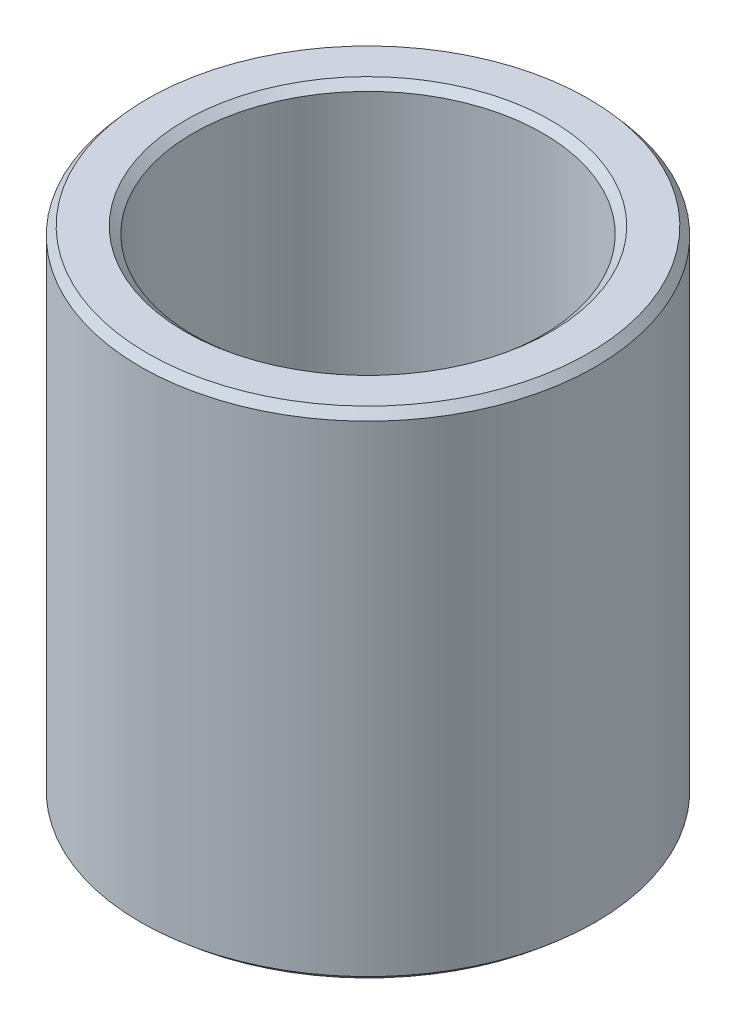
ISO-10303-21;
HEADER;
FILE_DESCRIPTION(('STEP AP214'),'2;1');
FILE_NAME('part.step','',(''),(''),'','','');
FILE_SCHEMA(('AUTOMOTIVE_DESIGN { 1 0 10303 214 1 1 1 1 }'));
ENDSEC;
DATA;
#1=APPLICATION_CONTEXT('core data for automotive mechanical design processes');
#2=APPLICATION_PROTOCOL_DEFINITION('international standard','automotive_design',2000,#1);
#3=PRODUCT_CONTEXT('',#1,'mechanical');
#4=PRODUCT('Part','Part','',(#3));
#5=PRODUCT_RELATED_PRODUCT_CATEGORY('part','',(#4));
#6=PRODUCT_DEFINITION_FORMATION('','',#4);
#7=PRODUCT_DEFINITION_CONTEXT('part definition',#1,'design');
#8=PRODUCT_DEFINITION('design','',#6,#7);
#9=PRODUCT_DEFINITION_SHAPE('','',#8);
#10=(LENGTH_UNIT() NAMED_UNIT(*) SI_UNIT(.MILLI.,.METRE.));
#11=(NAMED_UNIT(*) PLANE_ANGLE_UNIT() SI_UNIT($,.RADIAN.));
#12=(NAMED_UNIT(*) SI_UNIT($,.STERADIAN.) SOLID_ANGLE_UNIT());
#13=UNCERTAINTY_MEASURE_WITH_UNIT(LENGTH_MEASURE(1.E-05),#10,'distance_accuracy_value','');
#14=(GEOMETRIC_REPRESENTATION_CONTEXT(3) GLOBAL_UNCERTAINTY_ASSIGNED_CONTEXT((#13)) GLOBAL_UNIT_ASSIGNED_CONTEXT((#10,
#11,#12)) REPRESENTATION_CONTEXT('',''));
#15=CARTESIAN_POINT('',(0.,0.,0.));
#16=DIRECTION('',(0.,0.,1.));
#17=DIRECTION('',(1.,0.,0.));
#18=AXIS2_PLACEMENT_3D('',#15,#16,#17);
#19=CARTESIAN_POINT('',(0.,43.6122810332546,0.));
#20=DIRECTION('',(0.,-1.,0.));
#21=DIRECTION('',(0.,0.,-1.));
#22=AXIS2_PLACEMENT_3D('',#19,#20,#21);
#23=CYLINDRICAL_SURFACE('',#22,20.);
#24=CARTESIAN_POINT('',(0.,0.614561305969617,0.));
#25=DIRECTION('',(0.,1.,0.));
#26=DIRECTION('',(0.,0.,1.));
#27=AXIS2_PLACEMENT_3D('',#24,#25,#26);
#28=CIRCLE('',#27,20.);
#29=CARTESIAN_POINT('',(0.,0.614561305969617,20.));
#30=VERTEX_POINT('',#29);
#31=EDGE_CURVE('E10',#30,#30,#28,.T.);
#32=ORIENTED_EDGE('',*,*,#31,.T.);
#33=EDGE_LOOP('',(#32));
#34=FACE_BOUND('',#33,.T.);
#35=CARTESIAN_POINT('',(0.,42.8946810889523,0.));
#36=DIRECTION('',(0.,1.,0.));
#37=DIRECTION('',(0.,0.,1.));
#38=AXIS2_PLACEMENT_3D('',#35,#36,#37);
#39=CIRCLE('',#38,20.);
#40=CARTESIAN_POINT('',(0.,42.8946810889523,20.));
#41=VERTEX_POINT('',#40);
#42=EDGE_CURVE('E50',#41,#41,#39,.F.);
#43=ORIENTED_EDGE('',*,*,#42,.T.);
#44=EDGE_LOOP('',(#43));
#45=FACE_BOUND('',#44,.T.);
#46=ADVANCED_FACE('F39',(#34,#45),#23,.T.);
#47=CARTESIAN_POINT('',(0.,43.6122810332546,0.));
#48=DIRECTION('',(0.,1.,0.));
#49=DIRECTION('',(0.,0.,1.));
#50=AXIS2_PLACEMENT_3D('',#47,#48,#49);
#51=PLANE('',#50);
#52=CARTESIAN_POINT('',(0.,43.6122810332546,0.));
#53=DIRECTION('',(0.,1.,0.));
#54=DIRECTION('',(0.,0.,1.));
#55=AXIS2_PLACEMENT_3D('',#52,#53,#54);
#56=CIRCLE('',#55,16.0853511680827);
#57=CARTESIAN_POINT('',(0.,43.6122810332546,16.0853511680827));
#58=VERTEX_POINT('',#57);
#59=EDGE_CURVE('E58',#58,#58,#56,.F.);
#60=ORIENTED_EDGE('',*,*,#59,.T.);
#61=EDGE_LOOP('',(#60));
#62=FACE_BOUND('',#61,.T.);
#63=CARTESIAN_POINT('',(0.,43.6122810332546,0.));
#64=DIRECTION('',(0.,1.,0.));
#65=DIRECTION('',(0.,0.,1.));
#66=AXIS2_PLACEMENT_3D('',#63,#64,#65);
#67=CIRCLE('',#66,19.3854386940304);
#68=CARTESIAN_POINT('',(0.,43.6122810332546,19.3854386940304));
#69=VERTEX_POINT('',#68);
#70=EDGE_CURVE('E61',#69,#69,#67,.T.);
#71=ORIENTED_EDGE('',*,*,#70,.T.);
#72=EDGE_LOOP('',(#71));
#73=FACE_BOUND('',#72,.T.);
#74=ADVANCED_FACE('F88',(#62,#73),#51,.T.);
#75=CARTESIAN_POINT('',(0.,0.,0.));
#76=DIRECTION('',(0.,1.,0.));
#77=DIRECTION('',(0.,0.,1.));
#78=AXIS2_PLACEMENT_3D('',#75,#76,#77);
#79=PLANE('',#78);
#80=CARTESIAN_POINT('',(0.,0.,0.));
#81=DIRECTION('',(0.,1.,0.));
#82=DIRECTION('',(0.,0.,1.));
#83=AXIS2_PLACEMENT_3D('',#80,#81,#82);
#84=CIRCLE('',#83,15.9823125297501);
#85=CARTESIAN_POINT('',(0.,0.,15.9823125297501));
#86=VERTEX_POINT('',#85);
#87=EDGE_CURVE('E51',#86,#86,#84,.T.);
#88=ORIENTED_EDGE('',*,*,#87,.T.);
#89=EDGE_LOOP('',(#88));
#90=FACE_BOUND('',#89,.T.);
#91=CARTESIAN_POINT('',(0.,0.,0.));
#92=DIRECTION('',(0.,1.,0.));
#93=DIRECTION('',(0.,0.,1.));
#94=AXIS2_PLACEMENT_3D('',#91,#92,#93);
#95=CIRCLE('',#94,19.2824000556977);
#96=CARTESIAN_POINT('',(0.,0.,19.2824000556977));
#97=VERTEX_POINT('',#96);
#98=EDGE_CURVE('E54',#97,#97,#95,.F.);
#99=ORIENTED_EDGE('',*,*,#98,.T.);
#100=EDGE_LOOP('',(#99));
#101=FACE_BOUND('',#100,.T.);
#102=ADVANCED_FACE('F83',(#90,#101),#79,.F.);
#103=CARTESIAN_POINT('',(0.,43.6122810332546,0.));
#104=DIRECTION('',(0.,-1.,0.));
#105=DIRECTION('',(0.,0.,-1.));
#106=AXIS2_PLACEMENT_3D('',#103,#104,#105);
#107=CYLINDRICAL_SURFACE('',#106,15.3677512237805);
#108=CARTESIAN_POINT('',(0.,42.997719727285,0.));
#109=DIRECTION('',(0.,1.,0.));
#110=DIRECTION('',(0.,0.,1.));
#111=AXIS2_PLACEMENT_3D('',#108,#109,#110);
#112=CIRCLE('',#111,15.3677512237805);
#113=CARTESIAN_POINT('',(0.,42.997719727285,15.3677512237805));
#114=VERTEX_POINT('',#113);
#115=EDGE_CURVE('E67',#114,#114,#112,.T.);
#116=ORIENTED_EDGE('',*,*,#115,.T.);
#117=EDGE_LOOP('',(#116));
#118=FACE_BOUND('',#117,.T.);
#119=CARTESIAN_POINT('',(0.,0.717599944302282,0.));
#120=DIRECTION('',(0.,1.,0.));
#121=DIRECTION('',(0.,0.,1.));
#122=AXIS2_PLACEMENT_3D('',#119,#120,#121);
#123=CIRCLE('',#122,15.3677512237805);
#124=CARTESIAN_POINT('',(0.,0.717599944302282,15.3677512237805));
#125=VERTEX_POINT('',#124);
#126=EDGE_CURVE('E69',#125,#125,#123,.F.);
#127=ORIENTED_EDGE('',*,*,#126,.T.);
#128=EDGE_LOOP('',(#127));
#129=FACE_BOUND('',#128,.T.);
#130=ADVANCED_FACE('F71',(#118,#129),#107,.F.);
#131=CARTESIAN_POINT('',(0.,42.997719727285,0.));
#132=DIRECTION('',(0.,1.,0.));
#133=DIRECTION('',(0.,0.,1.));
#134=AXIS2_PLACEMENT_3D('',#131,#132,#133);
#135=CONICAL_SURFACE('',#134,15.3677512237805,0.862591442117799);
#136=ORIENTED_EDGE('',*,*,#59,.F.);
#137=EDGE_LOOP('',(#136));
#138=FACE_BOUND('',#137,.T.);
#139=ORIENTED_EDGE('',*,*,#115,.F.);
#140=EDGE_LOOP('',(#139));
#141=FACE_BOUND('',#140,.T.);
#142=ADVANCED_FACE('F77',(#138,#141),#135,.F.);
#143=CARTESIAN_POINT('',(0.,0.,0.));
#144=DIRECTION('',(0.,-1.,0.));
#145=DIRECTION('',(0.,0.,-1.));
#146=AXIS2_PLACEMENT_3D('',#143,#144,#145);
#147=CONICAL_SURFACE('',#146,15.9823125297501,0.708204884677089);
#148=ORIENTED_EDGE('',*,*,#126,.F.);
#149=EDGE_LOOP('',(#148));
#150=FACE_BOUND('',#149,.T.);
#151=ORIENTED_EDGE('',*,*,#87,.F.);
#152=EDGE_LOOP('',(#151));
#153=FACE_BOUND('',#152,.T.);
#154=ADVANCED_FACE('F73',(#150,#153),#147,.F.);
#155=CARTESIAN_POINT('',(0.,0.614561305969617,0.));
#156=DIRECTION('',(0.,1.,0.));
#157=DIRECTION('',(0.,0.,1.));
#158=AXIS2_PLACEMENT_3D('',#155,#156,#157);
#159=CONICAL_SURFACE('',#158,20.,0.862591442117805);
#160=ORIENTED_EDGE('',*,*,#98,.F.);
#161=EDGE_LOOP('',(#160));
#162=FACE_BOUND('',#161,.T.);
#163=ORIENTED_EDGE('',*,*,#31,.F.);
#164=EDGE_LOOP('',(#163));
#165=FACE_BOUND('',#164,.T.);
#166=ADVANCED_FACE('F76',(#162,#165),#159,.T.);
#167=CARTESIAN_POINT('',(0.,43.6122810332546,0.));
#168=DIRECTION('',(0.,-1.,0.));
#169=DIRECTION('',(0.,0.,-1.));
#170=AXIS2_PLACEMENT_3D('',#167,#168,#169);
#171=CONICAL_SURFACE('',#170,19.3854386940304,0.708204884677083);
#172=ORIENTED_EDGE('',*,*,#42,.F.);
#173=EDGE_LOOP('',(#172));
#174=FACE_BOUND('',#173,.T.);
#175=ORIENTED_EDGE('',*,*,#70,.F.);
#176=EDGE_LOOP('',(#175));
#177=FACE_BOUND('',#176,.T.);
#178=ADVANCED_FACE('F45',(#174,#177),#171,.T.);
#179=CLOSED_SHELL('',(#46,#74,#102,#130,#142,#154,#166,#178));
#180=MANIFOLD_SOLID_BREP('B2',#179);
#181=ADVANCED_BREP_SHAPE_REPRESENTATION('',(#18,#180),#14);
#182=SHAPE_DEFINITION_REPRESENTATION(#9,#181);
ENDSEC;
END-ISO-10303-21;
